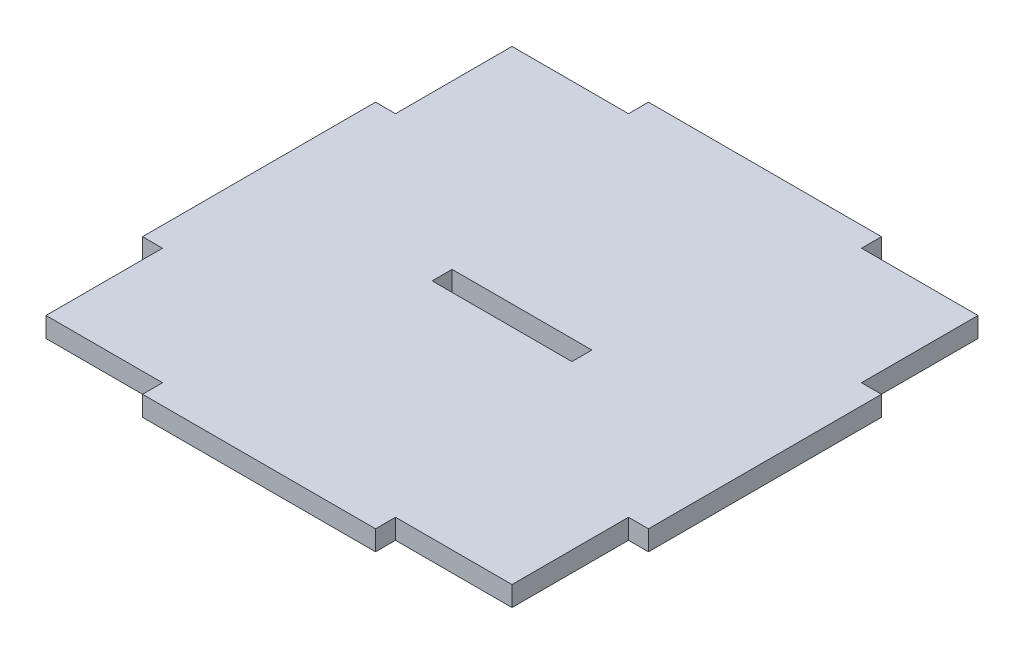
ISO-10303-21;
HEADER;
FILE_DESCRIPTION(('STEP AP214'),'2;1');
FILE_NAME('part.step','',(''),(''),'','','');
FILE_SCHEMA(('AUTOMOTIVE_DESIGN { 1 0 10303 214 1 1 1 1 }'));
ENDSEC;
DATA;
#1=APPLICATION_CONTEXT('core data for automotive mechanical design processes');
#2=APPLICATION_PROTOCOL_DEFINITION('international standard','automotive_design',2000,#1);
#3=PRODUCT_CONTEXT('',#1,'mechanical');
#4=PRODUCT('Part','Part','',(#3));
#5=PRODUCT_RELATED_PRODUCT_CATEGORY('part','',(#4));
#6=PRODUCT_DEFINITION_FORMATION('','',#4);
#7=PRODUCT_DEFINITION_CONTEXT('part definition',#1,'design');
#8=PRODUCT_DEFINITION('design','',#6,#7);
#9=PRODUCT_DEFINITION_SHAPE('','',#8);
#10=(LENGTH_UNIT() NAMED_UNIT(*) SI_UNIT(.MILLI.,.METRE.));
#11=(NAMED_UNIT(*) PLANE_ANGLE_UNIT() SI_UNIT($,.RADIAN.));
#12=(NAMED_UNIT(*) SI_UNIT($,.STERADIAN.) SOLID_ANGLE_UNIT());
#13=UNCERTAINTY_MEASURE_WITH_UNIT(LENGTH_MEASURE(1.E-05),#10,'distance_accuracy_value','');
#14=(GEOMETRIC_REPRESENTATION_CONTEXT(3) GLOBAL_UNCERTAINTY_ASSIGNED_CONTEXT((#13)) GLOBAL_UNIT_ASSIGNED_CONTEXT((#10,
#11,#12)) REPRESENTATION_CONTEXT('',''));
#15=CARTESIAN_POINT('',(0.,0.,0.));
#16=DIRECTION('',(0.,0.,1.));
#17=DIRECTION('',(1.,0.,0.));
#18=AXIS2_PLACEMENT_3D('',#15,#16,#17);
#19=CARTESIAN_POINT('',(35.,3.,-17.5));
#20=DIRECTION('',(-1.,0.,0.));
#21=DIRECTION('',(0.,0.,1.));
#22=AXIS2_PLACEMENT_3D('',#19,#20,#21);
#23=PLANE('',#22);
#24=DIRECTION('',(0.,0.,-1.));
#25=VECTOR('',#24,1.);
#26=CARTESIAN_POINT('',(35.,0.,-17.5));
#27=LINE('',#26,#25);
#28=CARTESIAN_POINT('',(35.,0.,-17.5));
#29=VERTEX_POINT('',#28);
#30=CARTESIAN_POINT('',(35.,0.,-35.));
#31=VERTEX_POINT('',#30);
#32=EDGE_CURVE('E230',#29,#31,#27,.T.);
#33=ORIENTED_EDGE('',*,*,#32,.T.);
#34=DIRECTION('',(0.,-1.,0.));
#35=VECTOR('',#34,1.);
#36=CARTESIAN_POINT('',(35.,3.,-35.));
#37=LINE('',#36,#35);
#38=CARTESIAN_POINT('',(35.,3.,-35.));
#39=VERTEX_POINT('',#38);
#40=EDGE_CURVE('E11',#39,#31,#37,.T.);
#41=ORIENTED_EDGE('',*,*,#40,.F.);
#42=DIRECTION('',(0.,0.,-1.));
#43=VECTOR('',#42,1.);
#44=CARTESIAN_POINT('',(35.,3.,-17.5));
#45=LINE('',#44,#43);
#46=CARTESIAN_POINT('',(35.,3.,-17.5));
#47=VERTEX_POINT('',#46);
#48=EDGE_CURVE('E234',#47,#39,#45,.T.);
#49=ORIENTED_EDGE('',*,*,#48,.F.);
#50=DIRECTION('',(0.,-1.,0.));
#51=VECTOR('',#50,1.);
#52=CARTESIAN_POINT('',(35.,3.,-17.5));
#53=LINE('',#52,#51);
#54=EDGE_CURVE('E276',#47,#29,#53,.T.);
#55=ORIENTED_EDGE('',*,*,#54,.T.);
#56=EDGE_LOOP('',(#33,#41,#49,#55));
#57=FACE_BOUND('',#56,.T.);
#58=ADVANCED_FACE('F37',(#57),#23,.F.);
#59=CARTESIAN_POINT('',(17.5,3.,-35.));
#60=DIRECTION('',(0.,0.,1.));
#61=DIRECTION('',(1.,0.,0.));
#62=AXIS2_PLACEMENT_3D('',#59,#60,#61);
#63=PLANE('',#62);
#64=DIRECTION('',(-1.,0.,0.));
#65=VECTOR('',#64,1.);
#66=CARTESIAN_POINT('',(17.5,0.,-35.));
#67=LINE('',#66,#65);
#68=CARTESIAN_POINT('',(17.5,0.,-35.));
#69=VERTEX_POINT('',#68);
#70=EDGE_CURVE('E279',#31,#69,#67,.T.);
#71=ORIENTED_EDGE('',*,*,#70,.T.);
#72=DIRECTION('',(0.,-1.,0.));
#73=VECTOR('',#72,1.);
#74=CARTESIAN_POINT('',(17.5,3.,-35.));
#75=LINE('',#74,#73);
#76=CARTESIAN_POINT('',(17.5,3.,-35.));
#77=VERTEX_POINT('',#76);
#78=EDGE_CURVE('E44',#77,#69,#75,.T.);
#79=ORIENTED_EDGE('',*,*,#78,.F.);
#80=DIRECTION('',(-1.,0.,0.));
#81=VECTOR('',#80,1.);
#82=CARTESIAN_POINT('',(17.5,3.,-35.));
#83=LINE('',#82,#81);
#84=EDGE_CURVE('E237',#39,#77,#83,.T.);
#85=ORIENTED_EDGE('',*,*,#84,.F.);
#86=ORIENTED_EDGE('',*,*,#40,.T.);
#87=EDGE_LOOP('',(#71,#79,#85,#86));
#88=FACE_BOUND('',#87,.T.);
#89=ADVANCED_FACE('F394',(#88),#63,.F.);
#90=CARTESIAN_POINT('',(17.5,3.,-38.));
#91=DIRECTION('',(-1.,0.,0.));
#92=DIRECTION('',(0.,0.,1.));
#93=AXIS2_PLACEMENT_3D('',#90,#91,#92);
#94=PLANE('',#93);
#95=DIRECTION('',(0.,0.,-1.));
#96=VECTOR('',#95,1.);
#97=CARTESIAN_POINT('',(17.5,0.,-38.));
#98=LINE('',#97,#96);
#99=CARTESIAN_POINT('',(17.5,0.,-38.));
#100=VERTEX_POINT('',#99);
#101=EDGE_CURVE('E281',#69,#100,#98,.T.);
#102=ORIENTED_EDGE('',*,*,#101,.T.);
#103=DIRECTION('',(0.,-1.,0.));
#104=VECTOR('',#103,1.);
#105=CARTESIAN_POINT('',(17.5,3.,-38.));
#106=LINE('',#105,#104);
#107=CARTESIAN_POINT('',(17.5,3.,-38.));
#108=VERTEX_POINT('',#107);
#109=EDGE_CURVE('E366',#108,#100,#106,.T.);
#110=ORIENTED_EDGE('',*,*,#109,.F.);
#111=DIRECTION('',(0.,0.,-1.));
#112=VECTOR('',#111,1.);
#113=CARTESIAN_POINT('',(17.5,3.,-38.));
#114=LINE('',#113,#112);
#115=EDGE_CURVE('E240',#77,#108,#114,.T.);
#116=ORIENTED_EDGE('',*,*,#115,.F.);
#117=ORIENTED_EDGE('',*,*,#78,.T.);
#118=EDGE_LOOP('',(#102,#110,#116,#117));
#119=FACE_BOUND('',#118,.T.);
#120=ADVANCED_FACE('F373',(#119),#94,.F.);
#121=CARTESIAN_POINT('',(-17.5,3.,-38.));
#122=DIRECTION('',(0.,0.,1.));
#123=DIRECTION('',(1.,0.,0.));
#124=AXIS2_PLACEMENT_3D('',#121,#122,#123);
#125=PLANE('',#124);
#126=DIRECTION('',(-1.,0.,0.));
#127=VECTOR('',#126,1.);
#128=CARTESIAN_POINT('',(-17.5,0.,-38.));
#129=LINE('',#128,#127);
#130=CARTESIAN_POINT('',(-17.5,0.,-38.));
#131=VERTEX_POINT('',#130);
#132=EDGE_CURVE('E283',#100,#131,#129,.T.);
#133=ORIENTED_EDGE('',*,*,#132,.T.);
#134=DIRECTION('',(0.,-1.,0.));
#135=VECTOR('',#134,1.);
#136=CARTESIAN_POINT('',(-17.5,3.,-38.));
#137=LINE('',#136,#135);
#138=CARTESIAN_POINT('',(-17.5,3.,-38.));
#139=VERTEX_POINT('',#138);
#140=EDGE_CURVE('E363',#139,#131,#137,.T.);
#141=ORIENTED_EDGE('',*,*,#140,.F.);
#142=DIRECTION('',(-1.,0.,0.));
#143=VECTOR('',#142,1.);
#144=CARTESIAN_POINT('',(-17.5,3.,-38.));
#145=LINE('',#144,#143);
#146=EDGE_CURVE('E242',#108,#139,#145,.T.);
#147=ORIENTED_EDGE('',*,*,#146,.F.);
#148=ORIENTED_EDGE('',*,*,#109,.T.);
#149=EDGE_LOOP('',(#133,#141,#147,#148));
#150=FACE_BOUND('',#149,.T.);
#151=ADVANCED_FACE('F382',(#150),#125,.F.);
#152=CARTESIAN_POINT('',(-17.5,3.,-38.));
#153=DIRECTION('',(1.,0.,0.));
#154=DIRECTION('',(0.,0.,-1.));
#155=AXIS2_PLACEMENT_3D('',#152,#153,#154);
#156=PLANE('',#155);
#157=DIRECTION('',(0.,0.,1.));
#158=VECTOR('',#157,1.);
#159=CARTESIAN_POINT('',(-17.5,0.,-38.));
#160=LINE('',#159,#158);
#161=CARTESIAN_POINT('',(-17.5,0.,-35.));
#162=VERTEX_POINT('',#161);
#163=EDGE_CURVE('E285',#131,#162,#160,.T.);
#164=ORIENTED_EDGE('',*,*,#163,.T.);
#165=DIRECTION('',(0.,-1.,0.));
#166=VECTOR('',#165,1.);
#167=CARTESIAN_POINT('',(-17.5,3.,-35.));
#168=LINE('',#167,#166);
#169=CARTESIAN_POINT('',(-17.5,3.,-35.));
#170=VERTEX_POINT('',#169);
#171=EDGE_CURVE('E360',#170,#162,#168,.T.);
#172=ORIENTED_EDGE('',*,*,#171,.F.);
#173=DIRECTION('',(0.,0.,1.));
#174=VECTOR('',#173,1.);
#175=CARTESIAN_POINT('',(-17.5,3.,-38.));
#176=LINE('',#175,#174);
#177=EDGE_CURVE('E244',#139,#170,#176,.T.);
#178=ORIENTED_EDGE('',*,*,#177,.F.);
#179=ORIENTED_EDGE('',*,*,#140,.T.);
#180=EDGE_LOOP('',(#164,#172,#178,#179));
#181=FACE_BOUND('',#180,.T.);
#182=ADVANCED_FACE('F386',(#181),#156,.F.);
#183=CARTESIAN_POINT('',(-35.,3.,-35.));
#184=DIRECTION('',(0.,0.,1.));
#185=DIRECTION('',(1.,0.,0.));
#186=AXIS2_PLACEMENT_3D('',#183,#184,#185);
#187=PLANE('',#186);
#188=DIRECTION('',(-1.,0.,0.));
#189=VECTOR('',#188,1.);
#190=CARTESIAN_POINT('',(-35.,0.,-35.));
#191=LINE('',#190,#189);
#192=CARTESIAN_POINT('',(-35.,0.,-35.));
#193=VERTEX_POINT('',#192);
#194=EDGE_CURVE('E287',#162,#193,#191,.T.);
#195=ORIENTED_EDGE('',*,*,#194,.T.);
#196=DIRECTION('',(0.,-1.,0.));
#197=VECTOR('',#196,1.);
#198=CARTESIAN_POINT('',(-35.,3.,-35.));
#199=LINE('',#198,#197);
#200=CARTESIAN_POINT('',(-35.,3.,-35.));
#201=VERTEX_POINT('',#200);
#202=EDGE_CURVE('E357',#201,#193,#199,.T.);
#203=ORIENTED_EDGE('',*,*,#202,.F.);
#204=DIRECTION('',(-1.,0.,0.));
#205=VECTOR('',#204,1.);
#206=CARTESIAN_POINT('',(-35.,3.,-35.));
#207=LINE('',#206,#205);
#208=EDGE_CURVE('E246',#170,#201,#207,.T.);
#209=ORIENTED_EDGE('',*,*,#208,.F.);
#210=ORIENTED_EDGE('',*,*,#171,.T.);
#211=EDGE_LOOP('',(#195,#203,#209,#210));
#212=FACE_BOUND('',#211,.T.);
#213=ADVANCED_FACE('F467',(#212),#187,.F.);
#214=CARTESIAN_POINT('',(-35.,3.,-17.5));
#215=DIRECTION('',(1.,0.,0.));
#216=DIRECTION('',(0.,0.,-1.));
#217=AXIS2_PLACEMENT_3D('',#214,#215,#216);
#218=PLANE('',#217);
#219=DIRECTION('',(0.,0.,1.));
#220=VECTOR('',#219,1.);
#221=CARTESIAN_POINT('',(-35.,0.,-17.5));
#222=LINE('',#221,#220);
#223=CARTESIAN_POINT('',(-35.,0.,-17.5));
#224=VERTEX_POINT('',#223);
#225=EDGE_CURVE('E289',#193,#224,#222,.T.);
#226=ORIENTED_EDGE('',*,*,#225,.T.);
#227=DIRECTION('',(0.,-1.,0.));
#228=VECTOR('',#227,1.);
#229=CARTESIAN_POINT('',(-35.,3.,-17.5));
#230=LINE('',#229,#228);
#231=CARTESIAN_POINT('',(-35.,3.,-17.5));
#232=VERTEX_POINT('',#231);
#233=EDGE_CURVE('E354',#232,#224,#230,.T.);
#234=ORIENTED_EDGE('',*,*,#233,.F.);
#235=DIRECTION('',(0.,0.,1.));
#236=VECTOR('',#235,1.);
#237=CARTESIAN_POINT('',(-35.,3.,-17.5));
#238=LINE('',#237,#236);
#239=EDGE_CURVE('E248',#201,#232,#238,.T.);
#240=ORIENTED_EDGE('',*,*,#239,.F.);
#241=ORIENTED_EDGE('',*,*,#202,.T.);
#242=EDGE_LOOP('',(#226,#234,#240,#241));
#243=FACE_BOUND('',#242,.T.);
#244=ADVANCED_FACE('F465',(#243),#218,.F.);
#245=CARTESIAN_POINT('',(-38.,3.,-17.5));
#246=DIRECTION('',(0.,0.,1.));
#247=DIRECTION('',(1.,0.,0.));
#248=AXIS2_PLACEMENT_3D('',#245,#246,#247);
#249=PLANE('',#248);
#250=DIRECTION('',(-1.,0.,0.));
#251=VECTOR('',#250,1.);
#252=CARTESIAN_POINT('',(-38.,0.,-17.5));
#253=LINE('',#252,#251);
#254=CARTESIAN_POINT('',(-38.,0.,-17.5));
#255=VERTEX_POINT('',#254);
#256=EDGE_CURVE('E291',#224,#255,#253,.T.);
#257=ORIENTED_EDGE('',*,*,#256,.T.);
#258=DIRECTION('',(0.,-1.,0.));
#259=VECTOR('',#258,1.);
#260=CARTESIAN_POINT('',(-38.,3.,-17.5));
#261=LINE('',#260,#259);
#262=CARTESIAN_POINT('',(-38.,3.,-17.5));
#263=VERTEX_POINT('',#262);
#264=EDGE_CURVE('E351',#263,#255,#261,.T.);
#265=ORIENTED_EDGE('',*,*,#264,.F.);
#266=DIRECTION('',(-1.,0.,0.));
#267=VECTOR('',#266,1.);
#268=CARTESIAN_POINT('',(-38.,3.,-17.5));
#269=LINE('',#268,#267);
#270=EDGE_CURVE('E250',#232,#263,#269,.T.);
#271=ORIENTED_EDGE('',*,*,#270,.F.);
#272=ORIENTED_EDGE('',*,*,#233,.T.);
#273=EDGE_LOOP('',(#257,#265,#271,#272));
#274=FACE_BOUND('',#273,.T.);
#275=ADVANCED_FACE('F460',(#274),#249,.F.);
#276=CARTESIAN_POINT('',(-38.,3.,17.5));
#277=DIRECTION('',(1.,0.,0.));
#278=DIRECTION('',(0.,0.,-1.));
#279=AXIS2_PLACEMENT_3D('',#276,#277,#278);
#280=PLANE('',#279);
#281=DIRECTION('',(0.,0.,1.));
#282=VECTOR('',#281,1.);
#283=CARTESIAN_POINT('',(-38.,0.,17.5));
#284=LINE('',#283,#282);
#285=CARTESIAN_POINT('',(-38.,0.,17.5));
#286=VERTEX_POINT('',#285);
#287=EDGE_CURVE('E293',#255,#286,#284,.T.);
#288=ORIENTED_EDGE('',*,*,#287,.T.);
#289=DIRECTION('',(0.,-1.,0.));
#290=VECTOR('',#289,1.);
#291=CARTESIAN_POINT('',(-38.,3.,17.5));
#292=LINE('',#291,#290);
#293=CARTESIAN_POINT('',(-38.,3.,17.5));
#294=VERTEX_POINT('',#293);
#295=EDGE_CURVE('E348',#294,#286,#292,.T.);
#296=ORIENTED_EDGE('',*,*,#295,.F.);
#297=DIRECTION('',(0.,0.,1.));
#298=VECTOR('',#297,1.);
#299=CARTESIAN_POINT('',(-38.,3.,17.5));
#300=LINE('',#299,#298);
#301=EDGE_CURVE('E252',#263,#294,#300,.T.);
#302=ORIENTED_EDGE('',*,*,#301,.F.);
#303=ORIENTED_EDGE('',*,*,#264,.T.);
#304=EDGE_LOOP('',(#288,#296,#302,#303));
#305=FACE_BOUND('',#304,.T.);
#306=ADVANCED_FACE('F455',(#305),#280,.F.);
#307=CARTESIAN_POINT('',(-38.,3.,17.5));
#308=DIRECTION('',(0.,0.,-1.));
#309=DIRECTION('',(-1.,0.,0.));
#310=AXIS2_PLACEMENT_3D('',#307,#308,#309);
#311=PLANE('',#310);
#312=DIRECTION('',(1.,0.,0.));
#313=VECTOR('',#312,1.);
#314=CARTESIAN_POINT('',(-38.,0.,17.5));
#315=LINE('',#314,#313);
#316=CARTESIAN_POINT('',(-35.,0.,17.5));
#317=VERTEX_POINT('',#316);
#318=EDGE_CURVE('E295',#286,#317,#315,.T.);
#319=ORIENTED_EDGE('',*,*,#318,.T.);
#320=DIRECTION('',(0.,-1.,0.));
#321=VECTOR('',#320,1.);
#322=CARTESIAN_POINT('',(-35.,3.,17.5));
#323=LINE('',#322,#321);
#324=CARTESIAN_POINT('',(-35.,3.,17.5));
#325=VERTEX_POINT('',#324);
#326=EDGE_CURVE('E345',#325,#317,#323,.T.);
#327=ORIENTED_EDGE('',*,*,#326,.F.);
#328=DIRECTION('',(1.,0.,0.));
#329=VECTOR('',#328,1.);
#330=CARTESIAN_POINT('',(-38.,3.,17.5));
#331=LINE('',#330,#329);
#332=EDGE_CURVE('E254',#294,#325,#331,.T.);
#333=ORIENTED_EDGE('',*,*,#332,.F.);
#334=ORIENTED_EDGE('',*,*,#295,.T.);
#335=EDGE_LOOP('',(#319,#327,#333,#334));
#336=FACE_BOUND('',#335,.T.);
#337=ADVANCED_FACE('F451',(#336),#311,.F.);
#338=CARTESIAN_POINT('',(-35.,3.,35.));
#339=DIRECTION('',(1.,0.,0.));
#340=DIRECTION('',(0.,0.,-1.));
#341=AXIS2_PLACEMENT_3D('',#338,#339,#340);
#342=PLANE('',#341);
#343=DIRECTION('',(0.,0.,1.));
#344=VECTOR('',#343,1.);
#345=CARTESIAN_POINT('',(-35.,0.,35.));
#346=LINE('',#345,#344);
#347=CARTESIAN_POINT('',(-35.,0.,35.));
#348=VERTEX_POINT('',#347);
#349=EDGE_CURVE('E297',#317,#348,#346,.T.);
#350=ORIENTED_EDGE('',*,*,#349,.T.);
#351=DIRECTION('',(0.,-1.,0.));
#352=VECTOR('',#351,1.);
#353=CARTESIAN_POINT('',(-35.,3.,35.));
#354=LINE('',#353,#352);
#355=CARTESIAN_POINT('',(-35.,3.,35.));
#356=VERTEX_POINT('',#355);
#357=EDGE_CURVE('E342',#356,#348,#354,.T.);
#358=ORIENTED_EDGE('',*,*,#357,.F.);
#359=DIRECTION('',(0.,0.,1.));
#360=VECTOR('',#359,1.);
#361=CARTESIAN_POINT('',(-35.,3.,35.));
#362=LINE('',#361,#360);
#363=EDGE_CURVE('E256',#325,#356,#362,.T.);
#364=ORIENTED_EDGE('',*,*,#363,.F.);
#365=ORIENTED_EDGE('',*,*,#326,.T.);
#366=EDGE_LOOP('',(#350,#358,#364,#365));
#367=FACE_BOUND('',#366,.T.);
#368=ADVANCED_FACE('F446',(#367),#342,.F.);
#369=CARTESIAN_POINT('',(-35.,3.,35.));
#370=DIRECTION('',(0.,0.,-1.));
#371=DIRECTION('',(-1.,0.,0.));
#372=AXIS2_PLACEMENT_3D('',#369,#370,#371);
#373=PLANE('',#372);
#374=DIRECTION('',(1.,0.,0.));
#375=VECTOR('',#374,1.);
#376=CARTESIAN_POINT('',(-35.,0.,35.));
#377=LINE('',#376,#375);
#378=CARTESIAN_POINT('',(-17.5,0.,35.));
#379=VERTEX_POINT('',#378);
#380=EDGE_CURVE('E299',#348,#379,#377,.T.);
#381=ORIENTED_EDGE('',*,*,#380,.T.);
#382=DIRECTION('',(0.,-1.,0.));
#383=VECTOR('',#382,1.);
#384=CARTESIAN_POINT('',(-17.5,3.,35.));
#385=LINE('',#384,#383);
#386=CARTESIAN_POINT('',(-17.5,3.,35.));
#387=VERTEX_POINT('',#386);
#388=EDGE_CURVE('E339',#387,#379,#385,.T.);
#389=ORIENTED_EDGE('',*,*,#388,.F.);
#390=DIRECTION('',(1.,0.,0.));
#391=VECTOR('',#390,1.);
#392=CARTESIAN_POINT('',(-35.,3.,35.));
#393=LINE('',#392,#391);
#394=EDGE_CURVE('E258',#356,#387,#393,.T.);
#395=ORIENTED_EDGE('',*,*,#394,.F.);
#396=ORIENTED_EDGE('',*,*,#357,.T.);
#397=EDGE_LOOP('',(#381,#389,#395,#396));
#398=FACE_BOUND('',#397,.T.);
#399=ADVANCED_FACE('F440',(#398),#373,.F.);
#400=CARTESIAN_POINT('',(-17.5,3.,38.));
#401=DIRECTION('',(1.,0.,0.));
#402=DIRECTION('',(0.,0.,-1.));
#403=AXIS2_PLACEMENT_3D('',#400,#401,#402);
#404=PLANE('',#403);
#405=DIRECTION('',(0.,0.,1.));
#406=VECTOR('',#405,1.);
#407=CARTESIAN_POINT('',(-17.5,0.,38.));
#408=LINE('',#407,#406);
#409=CARTESIAN_POINT('',(-17.5,0.,38.));
#410=VERTEX_POINT('',#409);
#411=EDGE_CURVE('E301',#379,#410,#408,.T.);
#412=ORIENTED_EDGE('',*,*,#411,.T.);
#413=DIRECTION('',(0.,-1.,0.));
#414=VECTOR('',#413,1.);
#415=CARTESIAN_POINT('',(-17.5,3.,38.));
#416=LINE('',#415,#414);
#417=CARTESIAN_POINT('',(-17.5,3.,38.));
#418=VERTEX_POINT('',#417);
#419=EDGE_CURVE('E336',#418,#410,#416,.T.);
#420=ORIENTED_EDGE('',*,*,#419,.F.);
#421=DIRECTION('',(0.,0.,1.));
#422=VECTOR('',#421,1.);
#423=CARTESIAN_POINT('',(-17.5,3.,38.));
#424=LINE('',#423,#422);
#425=EDGE_CURVE('E260',#387,#418,#424,.T.);
#426=ORIENTED_EDGE('',*,*,#425,.F.);
#427=ORIENTED_EDGE('',*,*,#388,.T.);
#428=EDGE_LOOP('',(#412,#420,#426,#427));
#429=FACE_BOUND('',#428,.T.);
#430=ADVANCED_FACE('F436',(#429),#404,.F.);
#431=CARTESIAN_POINT('',(-17.5,3.,38.));
#432=DIRECTION('',(0.,0.,-1.));
#433=DIRECTION('',(-1.,0.,0.));
#434=AXIS2_PLACEMENT_3D('',#431,#432,#433);
#435=PLANE('',#434);
#436=DIRECTION('',(1.,0.,0.));
#437=VECTOR('',#436,1.);
#438=CARTESIAN_POINT('',(-17.5,0.,38.));
#439=LINE('',#438,#437);
#440=CARTESIAN_POINT('',(17.5,0.,38.));
#441=VERTEX_POINT('',#440);
#442=EDGE_CURVE('E303',#410,#441,#439,.T.);
#443=ORIENTED_EDGE('',*,*,#442,.T.);
#444=DIRECTION('',(0.,-1.,0.));
#445=VECTOR('',#444,1.);
#446=CARTESIAN_POINT('',(17.5,3.,38.));
#447=LINE('',#446,#445);
#448=CARTESIAN_POINT('',(17.5,3.,38.));
#449=VERTEX_POINT('',#448);
#450=EDGE_CURVE('E333',#449,#441,#447,.T.);
#451=ORIENTED_EDGE('',*,*,#450,.F.);
#452=DIRECTION('',(1.,0.,0.));
#453=VECTOR('',#452,1.);
#454=CARTESIAN_POINT('',(-17.5,3.,38.));
#455=LINE('',#454,#453);
#456=EDGE_CURVE('E262',#418,#449,#455,.T.);
#457=ORIENTED_EDGE('',*,*,#456,.F.);
#458=ORIENTED_EDGE('',*,*,#419,.T.);
#459=EDGE_LOOP('',(#443,#451,#457,#458));
#460=FACE_BOUND('',#459,.T.);
#461=ADVANCED_FACE('F431',(#460),#435,.F.);
#462=CARTESIAN_POINT('',(17.5,3.,38.));
#463=DIRECTION('',(-1.,0.,0.));
#464=DIRECTION('',(0.,0.,1.));
#465=AXIS2_PLACEMENT_3D('',#462,#463,#464);
#466=PLANE('',#465);
#467=DIRECTION('',(0.,0.,-1.));
#468=VECTOR('',#467,1.);
#469=CARTESIAN_POINT('',(17.5,0.,38.));
#470=LINE('',#469,#468);
#471=CARTESIAN_POINT('',(17.5,0.,35.));
#472=VERTEX_POINT('',#471);
#473=EDGE_CURVE('E305',#441,#472,#470,.T.);
#474=ORIENTED_EDGE('',*,*,#473,.T.);
#475=DIRECTION('',(0.,-1.,0.));
#476=VECTOR('',#475,1.);
#477=CARTESIAN_POINT('',(17.5,3.,35.));
#478=LINE('',#477,#476);
#479=CARTESIAN_POINT('',(17.5,3.,35.));
#480=VERTEX_POINT('',#479);
#481=EDGE_CURVE('E330',#480,#472,#478,.T.);
#482=ORIENTED_EDGE('',*,*,#481,.F.);
#483=DIRECTION('',(0.,0.,-1.));
#484=VECTOR('',#483,1.);
#485=CARTESIAN_POINT('',(17.5,3.,38.));
#486=LINE('',#485,#484);
#487=EDGE_CURVE('E264',#449,#480,#486,.T.);
#488=ORIENTED_EDGE('',*,*,#487,.F.);
#489=ORIENTED_EDGE('',*,*,#450,.T.);
#490=EDGE_LOOP('',(#474,#482,#488,#489));
#491=FACE_BOUND('',#490,.T.);
#492=ADVANCED_FACE('F425',(#491),#466,.F.);
#493=CARTESIAN_POINT('',(17.5,3.,35.));
#494=DIRECTION('',(0.,0.,-1.));
#495=DIRECTION('',(-1.,0.,0.));
#496=AXIS2_PLACEMENT_3D('',#493,#494,#495);
#497=PLANE('',#496);
#498=DIRECTION('',(1.,0.,0.));
#499=VECTOR('',#498,1.);
#500=CARTESIAN_POINT('',(17.5,0.,35.));
#501=LINE('',#500,#499);
#502=CARTESIAN_POINT('',(35.,0.,35.));
#503=VERTEX_POINT('',#502);
#504=EDGE_CURVE('E307',#472,#503,#501,.T.);
#505=ORIENTED_EDGE('',*,*,#504,.T.);
#506=DIRECTION('',(0.,-1.,0.));
#507=VECTOR('',#506,1.);
#508=CARTESIAN_POINT('',(35.,3.,35.));
#509=LINE('',#508,#507);
#510=CARTESIAN_POINT('',(35.,3.,35.));
#511=VERTEX_POINT('',#510);
#512=EDGE_CURVE('E327',#511,#503,#509,.T.);
#513=ORIENTED_EDGE('',*,*,#512,.F.);
#514=DIRECTION('',(1.,0.,0.));
#515=VECTOR('',#514,1.);
#516=CARTESIAN_POINT('',(17.5,3.,35.));
#517=LINE('',#516,#515);
#518=EDGE_CURVE('E266',#480,#511,#517,.T.);
#519=ORIENTED_EDGE('',*,*,#518,.F.);
#520=ORIENTED_EDGE('',*,*,#481,.T.);
#521=EDGE_LOOP('',(#505,#513,#519,#520));
#522=FACE_BOUND('',#521,.T.);
#523=ADVANCED_FACE('F421',(#522),#497,.F.);
#524=CARTESIAN_POINT('',(35.,3.,35.));
#525=DIRECTION('',(-1.,0.,0.));
#526=DIRECTION('',(0.,0.,1.));
#527=AXIS2_PLACEMENT_3D('',#524,#525,#526);
#528=PLANE('',#527);
#529=DIRECTION('',(0.,0.,-1.));
#530=VECTOR('',#529,1.);
#531=CARTESIAN_POINT('',(35.,0.,35.));
#532=LINE('',#531,#530);
#533=CARTESIAN_POINT('',(35.,0.,17.5));
#534=VERTEX_POINT('',#533);
#535=EDGE_CURVE('E309',#503,#534,#532,.T.);
#536=ORIENTED_EDGE('',*,*,#535,.T.);
#537=DIRECTION('',(0.,-1.,0.));
#538=VECTOR('',#537,1.);
#539=CARTESIAN_POINT('',(35.,3.,17.5));
#540=LINE('',#539,#538);
#541=CARTESIAN_POINT('',(35.,3.,17.5));
#542=VERTEX_POINT('',#541);
#543=EDGE_CURVE('E324',#542,#534,#540,.T.);
#544=ORIENTED_EDGE('',*,*,#543,.F.);
#545=DIRECTION('',(0.,0.,-1.));
#546=VECTOR('',#545,1.);
#547=CARTESIAN_POINT('',(35.,3.,35.));
#548=LINE('',#547,#546);
#549=EDGE_CURVE('E268',#511,#542,#548,.T.);
#550=ORIENTED_EDGE('',*,*,#549,.F.);
#551=ORIENTED_EDGE('',*,*,#512,.T.);
#552=EDGE_LOOP('',(#536,#544,#550,#551));
#553=FACE_BOUND('',#552,.T.);
#554=ADVANCED_FACE('F416',(#553),#528,.F.);
#555=CARTESIAN_POINT('',(38.,3.,17.5));
#556=DIRECTION('',(0.,0.,-1.));
#557=DIRECTION('',(-1.,0.,0.));
#558=AXIS2_PLACEMENT_3D('',#555,#556,#557);
#559=PLANE('',#558);
#560=DIRECTION('',(1.,0.,0.));
#561=VECTOR('',#560,1.);
#562=CARTESIAN_POINT('',(38.,0.,17.5));
#563=LINE('',#562,#561);
#564=CARTESIAN_POINT('',(38.,0.,17.5));
#565=VERTEX_POINT('',#564);
#566=EDGE_CURVE('E311',#534,#565,#563,.T.);
#567=ORIENTED_EDGE('',*,*,#566,.T.);
#568=DIRECTION('',(0.,-1.,0.));
#569=VECTOR('',#568,1.);
#570=CARTESIAN_POINT('',(38.,3.,17.5));
#571=LINE('',#570,#569);
#572=CARTESIAN_POINT('',(38.,3.,17.5));
#573=VERTEX_POINT('',#572);
#574=EDGE_CURVE('E321',#573,#565,#571,.T.);
#575=ORIENTED_EDGE('',*,*,#574,.F.);
#576=DIRECTION('',(1.,0.,0.));
#577=VECTOR('',#576,1.);
#578=CARTESIAN_POINT('',(38.,3.,17.5));
#579=LINE('',#578,#577);
#580=EDGE_CURVE('E270',#542,#573,#579,.T.);
#581=ORIENTED_EDGE('',*,*,#580,.F.);
#582=ORIENTED_EDGE('',*,*,#543,.T.);
#583=EDGE_LOOP('',(#567,#575,#581,#582));
#584=FACE_BOUND('',#583,.T.);
#585=ADVANCED_FACE('F410',(#584),#559,.F.);
#586=CARTESIAN_POINT('',(38.,3.,-17.5));
#587=DIRECTION('',(-1.,0.,0.));
#588=DIRECTION('',(0.,0.,1.));
#589=AXIS2_PLACEMENT_3D('',#586,#587,#588);
#590=PLANE('',#589);
#591=DIRECTION('',(0.,0.,-1.));
#592=VECTOR('',#591,1.);
#593=CARTESIAN_POINT('',(38.,0.,-17.5));
#594=LINE('',#593,#592);
#595=CARTESIAN_POINT('',(38.,0.,-17.5));
#596=VERTEX_POINT('',#595);
#597=EDGE_CURVE('E313',#565,#596,#594,.T.);
#598=ORIENTED_EDGE('',*,*,#597,.T.);
#599=DIRECTION('',(0.,-1.,0.));
#600=VECTOR('',#599,1.);
#601=CARTESIAN_POINT('',(38.,3.,-17.5));
#602=LINE('',#601,#600);
#603=CARTESIAN_POINT('',(38.,3.,-17.5));
#604=VERTEX_POINT('',#603);
#605=EDGE_CURVE('E318',#604,#596,#602,.T.);
#606=ORIENTED_EDGE('',*,*,#605,.F.);
#607=DIRECTION('',(0.,0.,-1.));
#608=VECTOR('',#607,1.);
#609=CARTESIAN_POINT('',(38.,3.,-17.5));
#610=LINE('',#609,#608);
#611=EDGE_CURVE('E272',#573,#604,#610,.T.);
#612=ORIENTED_EDGE('',*,*,#611,.F.);
#613=ORIENTED_EDGE('',*,*,#574,.T.);
#614=EDGE_LOOP('',(#598,#606,#612,#613));
#615=FACE_BOUND('',#614,.T.);
#616=ADVANCED_FACE('F406',(#615),#590,.F.);
#617=CARTESIAN_POINT('',(38.,3.,-17.5));
#618=DIRECTION('',(0.,0.,1.));
#619=DIRECTION('',(1.,0.,0.));
#620=AXIS2_PLACEMENT_3D('',#617,#618,#619);
#621=PLANE('',#620);
#622=DIRECTION('',(-1.,0.,0.));
#623=VECTOR('',#622,1.);
#624=CARTESIAN_POINT('',(38.,0.,-17.5));
#625=LINE('',#624,#623);
#626=EDGE_CURVE('E238',#596,#29,#625,.T.);
#627=ORIENTED_EDGE('',*,*,#626,.T.);
#628=ORIENTED_EDGE('',*,*,#54,.F.);
#629=DIRECTION('',(-1.,0.,0.));
#630=VECTOR('',#629,1.);
#631=CARTESIAN_POINT('',(38.,3.,-17.5));
#632=LINE('',#631,#630);
#633=EDGE_CURVE('E274',#604,#47,#632,.T.);
#634=ORIENTED_EDGE('',*,*,#633,.F.);
#635=ORIENTED_EDGE('',*,*,#605,.T.);
#636=EDGE_LOOP('',(#627,#628,#634,#635));
#637=FACE_BOUND('',#636,.T.);
#638=ADVANCED_FACE('F401',(#637),#621,.F.);
#639=CARTESIAN_POINT('',(0.,3.,0.));
#640=DIRECTION('',(0.,-1.,0.));
#641=DIRECTION('',(0.,0.,-1.));
#642=AXIS2_PLACEMENT_3D('',#639,#640,#641);
#643=PLANE('',#642);
#644=DIRECTION('',(-1.,0.,0.));
#645=VECTOR('',#644,1.);
#646=CARTESIAN_POINT('',(-10.5,3.,-1.5));
#647=LINE('',#646,#645);
#648=CARTESIAN_POINT('',(10.5,3.,-1.5));
#649=VERTEX_POINT('',#648);
#650=CARTESIAN_POINT('',(-10.5,3.,-1.5));
#651=VERTEX_POINT('',#650);
#652=EDGE_CURVE('E224',#649,#651,#647,.T.);
#653=ORIENTED_EDGE('',*,*,#652,.F.);
#654=DIRECTION('',(0.,0.,-1.));
#655=VECTOR('',#654,1.);
#656=CARTESIAN_POINT('',(10.5,3.,1.5));
#657=LINE('',#656,#655);
#658=CARTESIAN_POINT('',(10.5,3.,1.5));
#659=VERTEX_POINT('',#658);
#660=EDGE_CURVE('E51',#659,#649,#657,.T.);
#661=ORIENTED_EDGE('',*,*,#660,.F.);
#662=DIRECTION('',(1.,0.,0.));
#663=VECTOR('',#662,1.);
#664=CARTESIAN_POINT('',(-10.5,3.,1.5));
#665=LINE('',#664,#663);
#666=CARTESIAN_POINT('',(-10.5,3.,1.5));
#667=VERTEX_POINT('',#666);
#668=EDGE_CURVE('E215',#667,#659,#665,.T.);
#669=ORIENTED_EDGE('',*,*,#668,.F.);
#670=DIRECTION('',(0.,0.,1.));
#671=VECTOR('',#670,1.);
#672=CARTESIAN_POINT('',(-10.5,3.,1.5));
#673=LINE('',#672,#671);
#674=EDGE_CURVE('E218',#651,#667,#673,.T.);
#675=ORIENTED_EDGE('',*,*,#674,.F.);
#676=EDGE_LOOP('',(#653,#661,#669,#675));
#677=FACE_BOUND('',#676,.T.);
#678=ORIENTED_EDGE('',*,*,#48,.T.);
#679=ORIENTED_EDGE('',*,*,#84,.T.);
#680=ORIENTED_EDGE('',*,*,#115,.T.);
#681=ORIENTED_EDGE('',*,*,#146,.T.);
#682=ORIENTED_EDGE('',*,*,#177,.T.);
#683=ORIENTED_EDGE('',*,*,#208,.T.);
#684=ORIENTED_EDGE('',*,*,#239,.T.);
#685=ORIENTED_EDGE('',*,*,#270,.T.);
#686=ORIENTED_EDGE('',*,*,#301,.T.);
#687=ORIENTED_EDGE('',*,*,#332,.T.);
#688=ORIENTED_EDGE('',*,*,#363,.T.);
#689=ORIENTED_EDGE('',*,*,#394,.T.);
#690=ORIENTED_EDGE('',*,*,#425,.T.);
#691=ORIENTED_EDGE('',*,*,#456,.T.);
#692=ORIENTED_EDGE('',*,*,#487,.T.);
#693=ORIENTED_EDGE('',*,*,#518,.T.);
#694=ORIENTED_EDGE('',*,*,#549,.T.);
#695=ORIENTED_EDGE('',*,*,#580,.T.);
#696=ORIENTED_EDGE('',*,*,#611,.T.);
#697=ORIENTED_EDGE('',*,*,#633,.T.);
#698=EDGE_LOOP('',(#678,#679,#680,#681,#682,#683,#684,#685,#686,#687,#688,#689,#690,#691,#692,
#693,#694,#695,#696,#697));
#699=FACE_BOUND('',#698,.T.);
#700=ADVANCED_FACE('F390',(#677,#699),#643,.F.);
#701=CARTESIAN_POINT('',(0.,0.,0.));
#702=DIRECTION('',(0.,-1.,0.));
#703=DIRECTION('',(0.,0.,-1.));
#704=AXIS2_PLACEMENT_3D('',#701,#702,#703);
#705=PLANE('',#704);
#706=DIRECTION('',(0.,0.,-1.));
#707=VECTOR('',#706,1.);
#708=CARTESIAN_POINT('',(10.5,0.,1.5));
#709=LINE('',#708,#707);
#710=CARTESIAN_POINT('',(10.5,0.,1.5));
#711=VERTEX_POINT('',#710);
#712=CARTESIAN_POINT('',(10.5,0.,-1.5));
#713=VERTEX_POINT('',#712);
#714=EDGE_CURVE('E199',#711,#713,#709,.T.);
#715=ORIENTED_EDGE('',*,*,#714,.T.);
#716=DIRECTION('',(-1.,0.,0.));
#717=VECTOR('',#716,1.);
#718=CARTESIAN_POINT('',(-10.5,0.,-1.5));
#719=LINE('',#718,#717);
#720=CARTESIAN_POINT('',(-10.5,0.,-1.5));
#721=VERTEX_POINT('',#720);
#722=EDGE_CURVE('E208',#713,#721,#719,.T.);
#723=ORIENTED_EDGE('',*,*,#722,.T.);
#724=DIRECTION('',(0.,0.,1.));
#725=VECTOR('',#724,1.);
#726=CARTESIAN_POINT('',(-10.5,0.,1.5));
#727=LINE('',#726,#725);
#728=CARTESIAN_POINT('',(-10.5,0.,1.5));
#729=VERTEX_POINT('',#728);
#730=EDGE_CURVE('E59',#721,#729,#727,.T.);
#731=ORIENTED_EDGE('',*,*,#730,.T.);
#732=DIRECTION('',(1.,0.,0.));
#733=VECTOR('',#732,1.);
#734=CARTESIAN_POINT('',(-10.5,0.,1.5));
#735=LINE('',#734,#733);
#736=EDGE_CURVE('E205',#729,#711,#735,.T.);
#737=ORIENTED_EDGE('',*,*,#736,.T.);
#738=EDGE_LOOP('',(#715,#723,#731,#737));
#739=FACE_BOUND('',#738,.T.);
#740=ORIENTED_EDGE('',*,*,#32,.F.);
#741=ORIENTED_EDGE('',*,*,#626,.F.);
#742=ORIENTED_EDGE('',*,*,#597,.F.);
#743=ORIENTED_EDGE('',*,*,#566,.F.);
#744=ORIENTED_EDGE('',*,*,#535,.F.);
#745=ORIENTED_EDGE('',*,*,#504,.F.);
#746=ORIENTED_EDGE('',*,*,#473,.F.);
#747=ORIENTED_EDGE('',*,*,#442,.F.);
#748=ORIENTED_EDGE('',*,*,#411,.F.);
#749=ORIENTED_EDGE('',*,*,#380,.F.);
#750=ORIENTED_EDGE('',*,*,#349,.F.);
#751=ORIENTED_EDGE('',*,*,#318,.F.);
#752=ORIENTED_EDGE('',*,*,#287,.F.);
#753=ORIENTED_EDGE('',*,*,#256,.F.);
#754=ORIENTED_EDGE('',*,*,#225,.F.);
#755=ORIENTED_EDGE('',*,*,#194,.F.);
#756=ORIENTED_EDGE('',*,*,#163,.F.);
#757=ORIENTED_EDGE('',*,*,#132,.F.);
#758=ORIENTED_EDGE('',*,*,#101,.F.);
#759=ORIENTED_EDGE('',*,*,#70,.F.);
#760=EDGE_LOOP('',(#740,#741,#742,#743,#744,#745,#746,#747,#748,#749,#750,#751,#752,#753,#754,
#755,#756,#757,#758,#759));
#761=FACE_BOUND('',#760,.T.);
#762=ADVANCED_FACE('F212',(#739,#761),#705,.T.);
#763=CARTESIAN_POINT('',(10.5,0.,1.5));
#764=DIRECTION('',(1.,0.,0.));
#765=DIRECTION('',(0.,0.,-1.));
#766=AXIS2_PLACEMENT_3D('',#763,#764,#765);
#767=PLANE('',#766);
#768=ORIENTED_EDGE('',*,*,#660,.T.);
#769=DIRECTION('',(0.,1.,0.));
#770=VECTOR('',#769,1.);
#771=CARTESIAN_POINT('',(10.5,0.,-1.5));
#772=LINE('',#771,#770);
#773=EDGE_CURVE('E195',#713,#649,#772,.T.);
#774=ORIENTED_EDGE('',*,*,#773,.F.);
#775=ORIENTED_EDGE('',*,*,#714,.F.);
#776=DIRECTION('',(0.,1.,0.));
#777=VECTOR('',#776,1.);
#778=CARTESIAN_POINT('',(10.5,0.,1.5));
#779=LINE('',#778,#777);
#780=EDGE_CURVE('E228',#711,#659,#779,.T.);
#781=ORIENTED_EDGE('',*,*,#780,.T.);
#782=EDGE_LOOP('',(#768,#774,#775,#781));
#783=FACE_BOUND('',#782,.T.);
#784=ADVANCED_FACE('F197',(#783),#767,.F.);
#785=CARTESIAN_POINT('',(-10.5,0.,1.5));
#786=DIRECTION('',(0.,0.,1.));
#787=DIRECTION('',(1.,0.,0.));
#788=AXIS2_PLACEMENT_3D('',#785,#786,#787);
#789=PLANE('',#788);
#790=ORIENTED_EDGE('',*,*,#668,.T.);
#791=ORIENTED_EDGE('',*,*,#780,.F.);
#792=ORIENTED_EDGE('',*,*,#736,.F.);
#793=DIRECTION('',(0.,1.,0.));
#794=VECTOR('',#793,1.);
#795=CARTESIAN_POINT('',(-10.5,0.,1.5));
#796=LINE('',#795,#794);
#797=EDGE_CURVE('E231',#729,#667,#796,.T.);
#798=ORIENTED_EDGE('',*,*,#797,.T.);
#799=EDGE_LOOP('',(#790,#791,#792,#798));
#800=FACE_BOUND('',#799,.T.);
#801=ADVANCED_FACE('F634',(#800),#789,.F.);
#802=CARTESIAN_POINT('',(-10.5,0.,1.5));
#803=DIRECTION('',(-1.,0.,0.));
#804=DIRECTION('',(0.,0.,1.));
#805=AXIS2_PLACEMENT_3D('',#802,#803,#804);
#806=PLANE('',#805);
#807=ORIENTED_EDGE('',*,*,#674,.T.);
#808=ORIENTED_EDGE('',*,*,#797,.F.);
#809=ORIENTED_EDGE('',*,*,#730,.F.);
#810=DIRECTION('',(0.,1.,0.));
#811=VECTOR('',#810,1.);
#812=CARTESIAN_POINT('',(-10.5,0.,-1.5));
#813=LINE('',#812,#811);
#814=EDGE_CURVE('E204',#721,#651,#813,.T.);
#815=ORIENTED_EDGE('',*,*,#814,.T.);
#816=EDGE_LOOP('',(#807,#808,#809,#815));
#817=FACE_BOUND('',#816,.T.);
#818=ADVANCED_FACE('F643',(#817),#806,.F.);
#819=CARTESIAN_POINT('',(-10.5,0.,-1.5));
#820=DIRECTION('',(0.,0.,-1.));
#821=DIRECTION('',(-1.,0.,0.));
#822=AXIS2_PLACEMENT_3D('',#819,#820,#821);
#823=PLANE('',#822);
#824=ORIENTED_EDGE('',*,*,#652,.T.);
#825=ORIENTED_EDGE('',*,*,#814,.F.);
#826=ORIENTED_EDGE('',*,*,#722,.F.);
#827=ORIENTED_EDGE('',*,*,#773,.T.);
#828=EDGE_LOOP('',(#824,#825,#826,#827));
#829=FACE_BOUND('',#828,.T.);
#830=ADVANCED_FACE('F209',(#829),#823,.F.);
#831=CLOSED_SHELL('',(#58,#89,#120,#151,#182,#213,#244,#275,#306,#337,#368,#399,#430,#461,#492,
#523,#554,#585,#616,#638,#700,#762,#784,#801,#818,#830));
#832=MANIFOLD_SOLID_BREP('B2',#831);
#833=ADVANCED_BREP_SHAPE_REPRESENTATION('',(#18,#832),#14);
#834=SHAPE_DEFINITION_REPRESENTATION(#9,#833);
ENDSEC;
END-ISO-10303-21;
